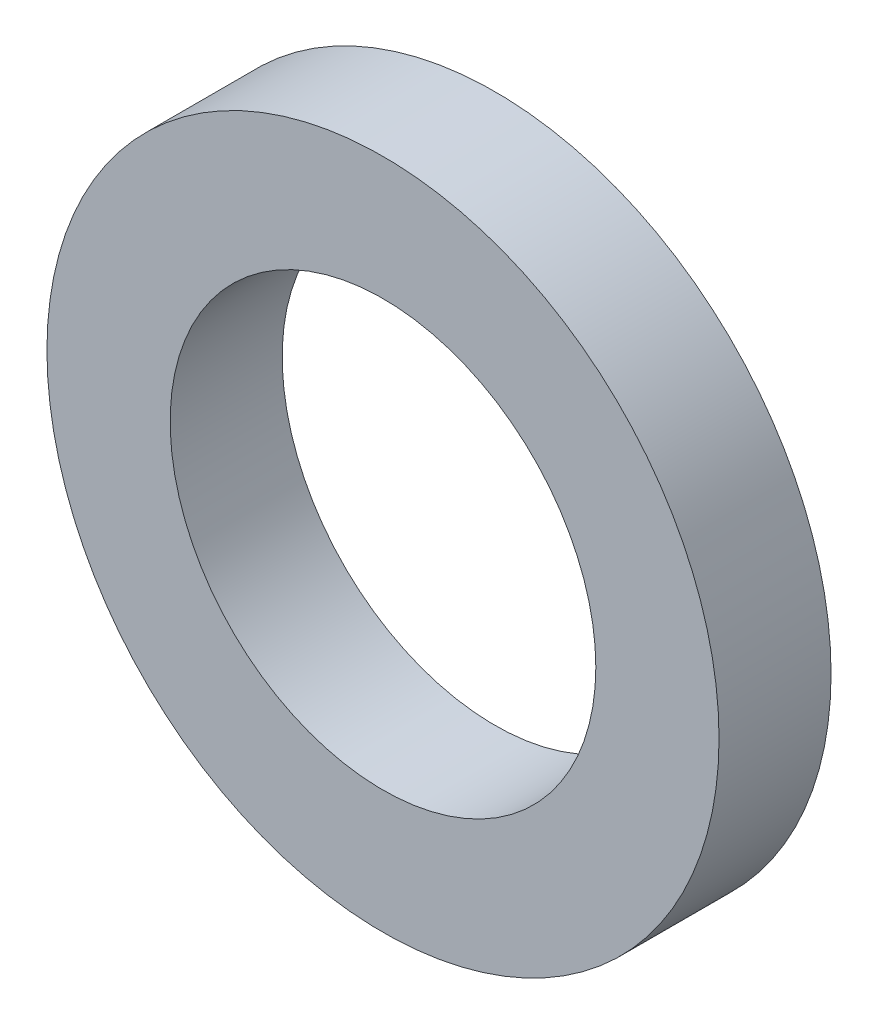
ISO-10303-21;
HEADER;
FILE_DESCRIPTION(('STEP AP214'),'2;1');
FILE_NAME('part.step','',(''),(''),'','','');
FILE_SCHEMA(('AUTOMOTIVE_DESIGN { 1 0 10303 214 1 1 1 1 }'));
ENDSEC;
DATA;
#1=APPLICATION_CONTEXT('core data for automotive mechanical design processes');
#2=APPLICATION_PROTOCOL_DEFINITION('international standard','automotive_design',2000,#1);
#3=PRODUCT_CONTEXT('',#1,'mechanical');
#4=PRODUCT('Part','Part','',(#3));
#5=PRODUCT_RELATED_PRODUCT_CATEGORY('part','',(#4));
#6=PRODUCT_DEFINITION_FORMATION('','',#4);
#7=PRODUCT_DEFINITION_CONTEXT('part definition',#1,'design');
#8=PRODUCT_DEFINITION('design','',#6,#7);
#9=PRODUCT_DEFINITION_SHAPE('','',#8);
#10=(LENGTH_UNIT() NAMED_UNIT(*) SI_UNIT(.MILLI.,.METRE.));
#11=(NAMED_UNIT(*) PLANE_ANGLE_UNIT() SI_UNIT($,.RADIAN.));
#12=(NAMED_UNIT(*) SI_UNIT($,.STERADIAN.) SOLID_ANGLE_UNIT());
#13=UNCERTAINTY_MEASURE_WITH_UNIT(LENGTH_MEASURE(1.E-05),#10,'distance_accuracy_value','');
#14=(GEOMETRIC_REPRESENTATION_CONTEXT(3) GLOBAL_UNCERTAINTY_ASSIGNED_CONTEXT((#13)) GLOBAL_UNIT_ASSIGNED_CONTEXT((#10,
#11,#12)) REPRESENTATION_CONTEXT('',''));
#15=CARTESIAN_POINT('',(0.,0.,0.));
#16=DIRECTION('',(0.,0.,1.));
#17=DIRECTION('',(1.,0.,0.));
#18=AXIS2_PLACEMENT_3D('',#15,#16,#17);
#19=CARTESIAN_POINT('',(0.,0.,1.));
#20=DIRECTION('',(0.,0.,1.));
#21=DIRECTION('',(1.,0.,0.));
#22=AXIS2_PLACEMENT_3D('',#19,#20,#21);
#23=PLANE('',#22);
#24=CARTESIAN_POINT('',(0.,0.,1.));
#25=DIRECTION('',(0.,0.,1.));
#26=DIRECTION('',(1.,0.,0.));
#27=AXIS2_PLACEMENT_3D('',#24,#25,#26);
#28=CIRCLE('',#27,3.);
#29=CARTESIAN_POINT('',(3.,0.,1.));
#30=VERTEX_POINT('',#29);
#31=EDGE_CURVE('E10',#30,#30,#28,.T.);
#32=ORIENTED_EDGE('',*,*,#31,.T.);
#33=EDGE_LOOP('',(#32));
#34=FACE_BOUND('',#33,.T.);
#35=CARTESIAN_POINT('',(0.,0.,1.));
#36=DIRECTION('',(0.,0.,1.));
#37=DIRECTION('',(1.,0.,0.));
#38=AXIS2_PLACEMENT_3D('',#35,#36,#37);
#39=CIRCLE('',#38,1.9);
#40=CARTESIAN_POINT('',(1.9,0.,1.));
#41=VERTEX_POINT('',#40);
#42=EDGE_CURVE('E48',#41,#41,#39,.T.);
#43=ORIENTED_EDGE('',*,*,#42,.F.);
#44=EDGE_LOOP('',(#43));
#45=FACE_BOUND('',#44,.T.);
#46=ADVANCED_FACE('F37',(#34,#45),#23,.T.);
#47=CARTESIAN_POINT('',(0.,0.,0.));
#48=DIRECTION('',(0.,0.,1.));
#49=DIRECTION('',(1.,0.,0.));
#50=AXIS2_PLACEMENT_3D('',#47,#48,#49);
#51=PLANE('',#50);
#52=CARTESIAN_POINT('',(0.,0.,0.));
#53=DIRECTION('',(0.,0.,1.));
#54=DIRECTION('',(1.,0.,0.));
#55=AXIS2_PLACEMENT_3D('',#52,#53,#54);
#56=CIRCLE('',#55,3.);
#57=CARTESIAN_POINT('',(3.,0.,0.));
#58=VERTEX_POINT('',#57);
#59=EDGE_CURVE('E41',#58,#58,#56,.T.);
#60=ORIENTED_EDGE('',*,*,#59,.F.);
#61=EDGE_LOOP('',(#60));
#62=FACE_BOUND('',#61,.T.);
#63=CARTESIAN_POINT('',(0.,0.,0.));
#64=DIRECTION('',(0.,0.,1.));
#65=DIRECTION('',(1.,0.,0.));
#66=AXIS2_PLACEMENT_3D('',#63,#64,#65);
#67=CIRCLE('',#66,1.9);
#68=CARTESIAN_POINT('',(1.9,0.,0.));
#69=VERTEX_POINT('',#68);
#70=EDGE_CURVE('E50',#69,#69,#67,.T.);
#71=ORIENTED_EDGE('',*,*,#70,.T.);
#72=EDGE_LOOP('',(#71));
#73=FACE_BOUND('',#72,.T.);
#74=ADVANCED_FACE('F60',(#62,#73),#51,.F.);
#75=CARTESIAN_POINT('',(0.,0.,1.));
#76=DIRECTION('',(0.,0.,-1.));
#77=DIRECTION('',(-1.,0.,0.));
#78=AXIS2_PLACEMENT_3D('',#75,#76,#77);
#79=CYLINDRICAL_SURFACE('',#78,3.);
#80=ORIENTED_EDGE('',*,*,#31,.F.);
#81=EDGE_LOOP('',(#80));
#82=FACE_BOUND('',#81,.T.);
#83=ORIENTED_EDGE('',*,*,#59,.T.);
#84=EDGE_LOOP('',(#83));
#85=FACE_BOUND('',#84,.T.);
#86=ADVANCED_FACE('F39',(#82,#85),#79,.T.);
#87=CARTESIAN_POINT('',(0.,0.,1.));
#88=DIRECTION('',(0.,0.,-1.));
#89=DIRECTION('',(-1.,0.,0.));
#90=AXIS2_PLACEMENT_3D('',#87,#88,#89);
#91=CYLINDRICAL_SURFACE('',#90,1.9);
#92=ORIENTED_EDGE('',*,*,#42,.T.);
#93=EDGE_LOOP('',(#92));
#94=FACE_BOUND('',#93,.T.);
#95=ORIENTED_EDGE('',*,*,#70,.F.);
#96=EDGE_LOOP('',(#95));
#97=FACE_BOUND('',#96,.T.);
#98=ADVANCED_FACE('F56',(#94,#97),#91,.F.);
#99=CLOSED_SHELL('',(#46,#74,#86,#98));
#100=MANIFOLD_SOLID_BREP('B2',#99);
#101=ADVANCED_BREP_SHAPE_REPRESENTATION('',(#18,#100),#14);
#102=SHAPE_DEFINITION_REPRESENTATION(#9,#101);
ENDSEC;
END-ISO-10303-21;
